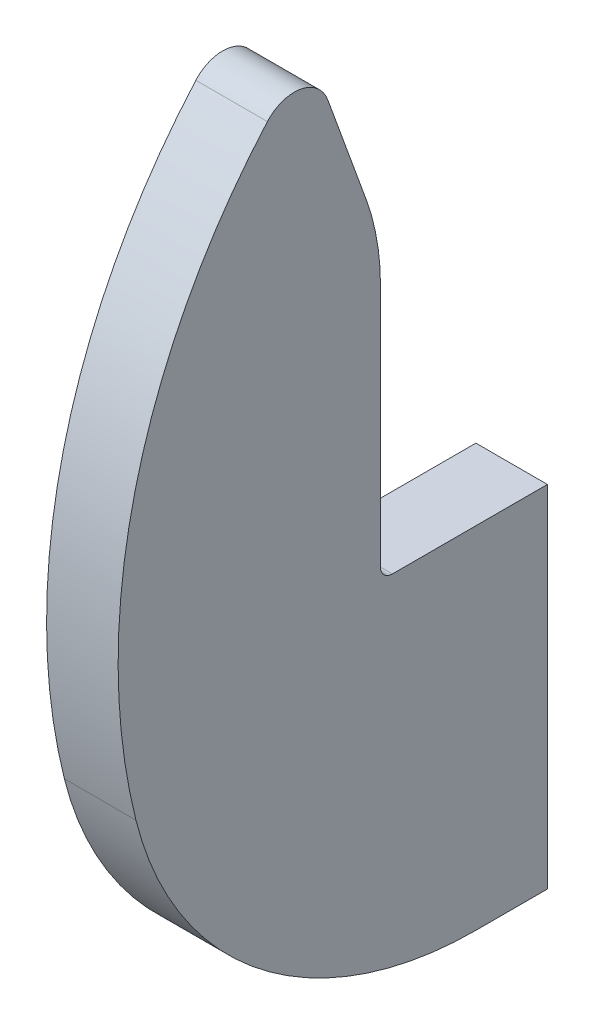
ISO-10303-21;
HEADER;
FILE_DESCRIPTION(('STEP AP214'),'2;1');
FILE_NAME('part.step','',(''),(''),'','','');
FILE_SCHEMA(('AUTOMOTIVE_DESIGN { 1 0 10303 214 1 1 1 1 }'));
ENDSEC;
DATA;
#1=APPLICATION_CONTEXT('core data for automotive mechanical design processes');
#2=APPLICATION_PROTOCOL_DEFINITION('international standard','automotive_design',2000,#1);
#3=PRODUCT_CONTEXT('',#1,'mechanical');
#4=PRODUCT('Part','Part','',(#3));
#5=PRODUCT_RELATED_PRODUCT_CATEGORY('part','',(#4));
#6=PRODUCT_DEFINITION_FORMATION('','',#4);
#7=PRODUCT_DEFINITION_CONTEXT('part definition',#1,'design');
#8=PRODUCT_DEFINITION('design','',#6,#7);
#9=PRODUCT_DEFINITION_SHAPE('','',#8);
#10=(LENGTH_UNIT() NAMED_UNIT(*) SI_UNIT(.MILLI.,.METRE.));
#11=(NAMED_UNIT(*) PLANE_ANGLE_UNIT() SI_UNIT($,.RADIAN.));
#12=(NAMED_UNIT(*) SI_UNIT($,.STERADIAN.) SOLID_ANGLE_UNIT());
#13=UNCERTAINTY_MEASURE_WITH_UNIT(LENGTH_MEASURE(1.E-05),#10,'distance_accuracy_value','');
#14=(GEOMETRIC_REPRESENTATION_CONTEXT(3) GLOBAL_UNCERTAINTY_ASSIGNED_CONTEXT((#13)) GLOBAL_UNIT_ASSIGNED_CONTEXT((#10,
#11,#12)) REPRESENTATION_CONTEXT('',''));
#15=CARTESIAN_POINT('',(0.,0.,0.));
#16=DIRECTION('',(0.,0.,1.));
#17=DIRECTION('',(1.,0.,0.));
#18=AXIS2_PLACEMENT_3D('',#15,#16,#17);
#19=CARTESIAN_POINT('',(298.,590.,586.887726592989));
#20=DIRECTION('',(0.,0.,-1.));
#21=DIRECTION('',(-1.,0.,0.));
#22=AXIS2_PLACEMENT_3D('',#19,#20,#21);
#23=PLANE('',#22);
#24=DIRECTION('',(0.,-1.,0.));
#25=VECTOR('',#24,1.);
#26=CARTESIAN_POINT('',(298.,590.,586.887726592989));
#27=LINE('',#26,#25);
#28=CARTESIAN_POINT('',(298.,611.473460385831,586.887726592989));
#29=VERTEX_POINT('',#28);
#30=CARTESIAN_POINT('',(298.,591.,586.887726592989));
#31=VERTEX_POINT('',#30);
#32=EDGE_CURVE('E118',#29,#31,#27,.T.);
#33=ORIENTED_EDGE('',*,*,#32,.T.);
#34=DIRECTION('',(-1.,0.,0.));
#35=VECTOR('',#34,1.);
#36=CARTESIAN_POINT('',(292.,591.,586.887726592989));
#37=LINE('',#36,#35);
#38=CARTESIAN_POINT('',(292.,591.,586.887726592989));
#39=VERTEX_POINT('',#38);
#40=EDGE_CURVE('E185',#31,#39,#37,.T.);
#41=ORIENTED_EDGE('',*,*,#40,.T.);
#42=DIRECTION('',(0.,-1.,0.));
#43=VECTOR('',#42,1.);
#44=CARTESIAN_POINT('',(292.,590.,586.887726592989));
#45=LINE('',#44,#43);
#46=CARTESIAN_POINT('',(292.,611.473460385831,586.887726592989));
#47=VERTEX_POINT('',#46);
#48=EDGE_CURVE('E145',#47,#39,#45,.T.);
#49=ORIENTED_EDGE('',*,*,#48,.F.);
#50=DIRECTION('',(-1.,0.,0.));
#51=VECTOR('',#50,1.);
#52=CARTESIAN_POINT('',(298.,611.473460385831,586.887726592989));
#53=LINE('',#52,#51);
#54=EDGE_CURVE('E171',#47,#29,#53,.F.);
#55=ORIENTED_EDGE('',*,*,#54,.T.);
#56=EDGE_LOOP('',(#33,#41,#49,#55));
#57=FACE_BOUND('',#56,.T.);
#58=ADVANCED_FACE('F36',(#57),#23,.T.);
#59=CARTESIAN_POINT('',(298.,615.,586.887726592989));
#60=DIRECTION('',(0.,0.34202014332568,-0.939692620785904));
#61=DIRECTION('',(0.,0.939692620785905,0.34202014332568));
#62=AXIS2_PLACEMENT_3D('',#59,#60,#61);
#63=PLANE('',#62);
#64=DIRECTION('',(0.,-0.939692620785904,-0.34202014332568));
#65=VECTOR('',#64,1.);
#66=CARTESIAN_POINT('',(292.,615.,586.887726592989));
#67=LINE('',#66,#65);
#68=CARTESIAN_POINT('',(292.,627.13122463831,591.303131266531));
#69=VERTEX_POINT('',#68);
#70=CARTESIAN_POINT('',(292.,618.313863252344,588.093874177271));
#71=VERTEX_POINT('',#70);
#72=EDGE_CURVE('E159',#69,#71,#67,.T.);
#73=ORIENTED_EDGE('',*,*,#72,.F.);
#74=DIRECTION('',(-1.,0.,0.));
#75=VECTOR('',#74,1.);
#76=CARTESIAN_POINT('',(298.,627.13122463831,591.303131266531));
#77=LINE('',#76,#75);
#78=CARTESIAN_POINT('',(298.,627.13122463831,591.303131266531));
#79=VERTEX_POINT('',#78);
#80=EDGE_CURVE('E181',#69,#79,#77,.F.);
#81=ORIENTED_EDGE('',*,*,#80,.T.);
#82=DIRECTION('',(0.,-0.939692620785904,-0.34202014332568));
#83=VECTOR('',#82,1.);
#84=CARTESIAN_POINT('',(298.,615.,586.887726592989));
#85=LINE('',#84,#83);
#86=CARTESIAN_POINT('',(298.,618.313863252344,588.093874177271));
#87=VERTEX_POINT('',#86);
#88=EDGE_CURVE('E126',#79,#87,#85,.T.);
#89=ORIENTED_EDGE('',*,*,#88,.T.);
#90=DIRECTION('',(-1.,0.,0.));
#91=VECTOR('',#90,1.);
#92=CARTESIAN_POINT('',(298.,618.313863252344,588.093874177271));
#93=LINE('',#92,#91);
#94=EDGE_CURVE('E163',#87,#71,#93,.T.);
#95=ORIENTED_EDGE('',*,*,#94,.T.);
#96=EDGE_LOOP('',(#73,#81,#89,#95));
#97=FACE_BOUND('',#96,.T.);
#98=ADVANCED_FACE('F203',(#97),#63,.T.);
#99=CARTESIAN_POINT('',(298.,595.,558.887726592989));
#100=DIRECTION('',(-1.,0.,0.));
#101=DIRECTION('',(0.,0.,1.));
#102=AXIS2_PLACEMENT_3D('',#99,#100,#101);
#103=CYLINDRICAL_SURFACE('',#102,50.);
#104=CARTESIAN_POINT('',(298.,595.,558.887726592989));
#105=DIRECTION('',(-1.,0.,0.));
#106=DIRECTION('',(0.,0.,1.));
#107=AXIS2_PLACEMENT_3D('',#104,#105,#106);
#108=CIRCLE('',#107,50.);
#109=CARTESIAN_POINT('',(298.,582.873218748183,607.394851600256));
#110=VERTEX_POINT('',#109);
#111=CARTESIAN_POINT('',(298.,628.090600221631,596.371218652457));
#112=VERTEX_POINT('',#111);
#113=EDGE_CURVE('E141',#110,#112,#108,.T.);
#114=ORIENTED_EDGE('',*,*,#113,.T.);
#115=DIRECTION('',(-1.,0.,0.));
#116=VECTOR('',#115,1.);
#117=CARTESIAN_POINT('',(298.,628.090600221631,596.371218652457));
#118=LINE('',#117,#116);
#119=CARTESIAN_POINT('',(292.,628.090600221631,596.371218652457));
#120=VERTEX_POINT('',#119);
#121=EDGE_CURVE('E176',#112,#120,#118,.T.);
#122=ORIENTED_EDGE('',*,*,#121,.T.);
#123=CARTESIAN_POINT('',(292.,595.,558.887726592989));
#124=DIRECTION('',(-1.,0.,0.));
#125=DIRECTION('',(0.,0.,1.));
#126=AXIS2_PLACEMENT_3D('',#123,#124,#125);
#127=CIRCLE('',#126,50.);
#128=CARTESIAN_POINT('',(292.,582.873218748183,607.394851600256));
#129=VERTEX_POINT('',#128);
#130=EDGE_CURVE('E156',#129,#120,#127,.T.);
#131=ORIENTED_EDGE('',*,*,#130,.F.);
#132=DIRECTION('',(-1.,0.,0.));
#133=VECTOR('',#132,1.);
#134=CARTESIAN_POINT('',(298.,582.873218748183,607.394851600256));
#135=LINE('',#134,#133);
#136=EDGE_CURVE('E161',#110,#129,#135,.T.);
#137=ORIENTED_EDGE('',*,*,#136,.F.);
#138=EDGE_LOOP('',(#114,#122,#131,#137));
#139=FACE_BOUND('',#138,.T.);
#140=ADVANCED_FACE('F217',(#139),#103,.T.);
#141=CARTESIAN_POINT('',(298.,590.,578.88772659299));
#142=DIRECTION('',(-1.,0.,0.));
#143=DIRECTION('',(0.,0.,1.));
#144=AXIS2_PLACEMENT_3D('',#141,#142,#143);
#145=CYLINDRICAL_SURFACE('',#144,29.3844718719115);
#146=CARTESIAN_POINT('',(292.,590.,578.88772659299));
#147=DIRECTION('',(-1.,0.,0.));
#148=DIRECTION('',(0.,0.,1.));
#149=AXIS2_PLACEMENT_3D('',#146,#147,#148);
#150=CIRCLE('',#149,29.3844718719115);
#151=CARTESIAN_POINT('',(292.,560.615528128088,578.88772659299));
#152=VERTEX_POINT('',#151);
#153=EDGE_CURVE('E153',#152,#129,#150,.T.);
#154=ORIENTED_EDGE('',*,*,#153,.F.);
#155=DIRECTION('',(-1.,0.,0.));
#156=VECTOR('',#155,1.);
#157=CARTESIAN_POINT('',(298.,560.615528128088,578.88772659299));
#158=LINE('',#157,#156);
#159=CARTESIAN_POINT('',(298.,560.615528128088,578.88772659299));
#160=VERTEX_POINT('',#159);
#161=EDGE_CURVE('E164',#160,#152,#158,.T.);
#162=ORIENTED_EDGE('',*,*,#161,.F.);
#163=CARTESIAN_POINT('',(298.,590.,578.88772659299));
#164=DIRECTION('',(-1.,0.,0.));
#165=DIRECTION('',(0.,0.,1.));
#166=AXIS2_PLACEMENT_3D('',#163,#164,#165);
#167=CIRCLE('',#166,29.3844718719115);
#168=EDGE_CURVE('E135',#160,#110,#167,.T.);
#169=ORIENTED_EDGE('',*,*,#168,.T.);
#170=ORIENTED_EDGE('',*,*,#136,.T.);
#171=EDGE_LOOP('',(#154,#162,#169,#170));
#172=FACE_BOUND('',#171,.T.);
#173=ADVANCED_FACE('F234',(#172),#145,.T.);
#174=CARTESIAN_POINT('',(298.,560.615528128088,578.88772659299));
#175=DIRECTION('',(0.,-1.,0.));
#176=DIRECTION('',(0.,0.,-1.));
#177=AXIS2_PLACEMENT_3D('',#174,#175,#176);
#178=PLANE('',#177);
#179=DIRECTION('',(0.,0.,1.));
#180=VECTOR('',#179,1.);
#181=CARTESIAN_POINT('',(292.,560.615528128088,578.88772659299));
#182=LINE('',#181,#180);
#183=CARTESIAN_POINT('',(292.,560.615528128088,572.88772659299));
#184=VERTEX_POINT('',#183);
#185=EDGE_CURVE('E150',#184,#152,#182,.T.);
#186=ORIENTED_EDGE('',*,*,#185,.F.);
#187=DIRECTION('',(-1.,0.,0.));
#188=VECTOR('',#187,1.);
#189=CARTESIAN_POINT('',(298.,560.615528128088,572.88772659299));
#190=LINE('',#189,#188);
#191=CARTESIAN_POINT('',(298.,560.615528128088,572.88772659299));
#192=VERTEX_POINT('',#191);
#193=EDGE_CURVE('E125',#192,#184,#190,.T.);
#194=ORIENTED_EDGE('',*,*,#193,.F.);
#195=DIRECTION('',(0.,0.,1.));
#196=VECTOR('',#195,1.);
#197=CARTESIAN_POINT('',(298.,560.615528128088,578.88772659299));
#198=LINE('',#197,#196);
#199=EDGE_CURVE('E133',#192,#160,#198,.T.);
#200=ORIENTED_EDGE('',*,*,#199,.T.);
#201=ORIENTED_EDGE('',*,*,#161,.T.);
#202=EDGE_LOOP('',(#186,#194,#200,#201));
#203=FACE_BOUND('',#202,.T.);
#204=ADVANCED_FACE('F238',(#203),#178,.T.);
#205=CARTESIAN_POINT('',(298.,560.615528128088,572.88772659299));
#206=DIRECTION('',(0.,0.,-1.));
#207=DIRECTION('',(-1.,0.,0.));
#208=AXIS2_PLACEMENT_3D('',#205,#206,#207);
#209=PLANE('',#208);
#210=DIRECTION('',(0.,-1.,0.));
#211=VECTOR('',#210,1.);
#212=CARTESIAN_POINT('',(292.,560.615528128088,572.88772659299));
#213=LINE('',#212,#211);
#214=CARTESIAN_POINT('',(292.,590.,572.88772659299));
#215=VERTEX_POINT('',#214);
#216=EDGE_CURVE('E124',#215,#184,#213,.T.);
#217=ORIENTED_EDGE('',*,*,#216,.F.);
#218=DIRECTION('',(-1.,0.,0.));
#219=VECTOR('',#218,1.);
#220=CARTESIAN_POINT('',(298.,590.,572.88772659299));
#221=LINE('',#220,#219);
#222=CARTESIAN_POINT('',(298.,590.,572.88772659299));
#223=VERTEX_POINT('',#222);
#224=EDGE_CURVE('E112',#223,#215,#221,.T.);
#225=ORIENTED_EDGE('',*,*,#224,.F.);
#226=DIRECTION('',(0.,-1.,0.));
#227=VECTOR('',#226,1.);
#228=CARTESIAN_POINT('',(298.,560.615528128088,572.88772659299));
#229=LINE('',#228,#227);
#230=EDGE_CURVE('E117',#223,#192,#229,.T.);
#231=ORIENTED_EDGE('',*,*,#230,.T.);
#232=ORIENTED_EDGE('',*,*,#193,.T.);
#233=EDGE_LOOP('',(#217,#225,#231,#232));
#234=FACE_BOUND('',#233,.T.);
#235=ADVANCED_FACE('F122',(#234),#209,.T.);
#236=CARTESIAN_POINT('',(298.,590.,572.88772659299));
#237=DIRECTION('',(0.,1.,0.));
#238=DIRECTION('',(0.,0.,1.));
#239=AXIS2_PLACEMENT_3D('',#236,#237,#238);
#240=PLANE('',#239);
#241=DIRECTION('',(0.,0.,-1.));
#242=VECTOR('',#241,1.);
#243=CARTESIAN_POINT('',(292.,590.,572.88772659299));
#244=LINE('',#243,#242);
#245=CARTESIAN_POINT('',(292.,590.,585.887726592989));
#246=VERTEX_POINT('',#245);
#247=EDGE_CURVE('E147',#246,#215,#244,.T.);
#248=ORIENTED_EDGE('',*,*,#247,.F.);
#249=DIRECTION('',(-1.,0.,0.));
#250=VECTOR('',#249,1.);
#251=CARTESIAN_POINT('',(298.,590.,585.887726592989));
#252=LINE('',#251,#250);
#253=CARTESIAN_POINT('',(298.,590.,585.887726592989));
#254=VERTEX_POINT('',#253);
#255=EDGE_CURVE('E51',#246,#254,#252,.F.);
#256=ORIENTED_EDGE('',*,*,#255,.T.);
#257=DIRECTION('',(0.,0.,-1.));
#258=VECTOR('',#257,1.);
#259=CARTESIAN_POINT('',(298.,590.,586.887726592989));
#260=LINE('',#259,#258);
#261=EDGE_CURVE('E109',#254,#223,#260,.T.);
#262=ORIENTED_EDGE('',*,*,#261,.T.);
#263=ORIENTED_EDGE('',*,*,#224,.T.);
#264=EDGE_LOOP('',(#248,#256,#262,#263));
#265=FACE_BOUND('',#264,.T.);
#266=ADVANCED_FACE('F111',(#265),#240,.T.);
#267=CARTESIAN_POINT('',(298.,595.,558.887726592989));
#268=DIRECTION('',(-1.,0.,0.));
#269=DIRECTION('',(0.,0.,1.));
#270=AXIS2_PLACEMENT_3D('',#267,#268,#269);
#271=PLANE('',#270);
#272=ORIENTED_EDGE('',*,*,#88,.F.);
#273=CARTESIAN_POINT('',(298.,626.105164208333,594.122209128889));
#274=DIRECTION('',(-1.,0.,0.));
#275=DIRECTION('',(0.,0.,1.));
#276=AXIS2_PLACEMENT_3D('',#273,#274,#275);
#277=CIRCLE('',#276,3.);
#278=EDGE_CURVE('E183',#79,#112,#277,.F.);
#279=ORIENTED_EDGE('',*,*,#278,.T.);
#280=ORIENTED_EDGE('',*,*,#113,.F.);
#281=ORIENTED_EDGE('',*,*,#168,.F.);
#282=ORIENTED_EDGE('',*,*,#199,.F.);
#283=ORIENTED_EDGE('',*,*,#230,.F.);
#284=ORIENTED_EDGE('',*,*,#261,.F.);
#285=CARTESIAN_POINT('',(298.,591.,585.887726592989));
#286=DIRECTION('',(-1.,0.,0.));
#287=DIRECTION('',(0.,0.,1.));
#288=AXIS2_PLACEMENT_3D('',#285,#286,#287);
#289=CIRCLE('',#288,1.);
#290=EDGE_CURVE('E11',#254,#31,#289,.T.);
#291=ORIENTED_EDGE('',*,*,#290,.T.);
#292=ORIENTED_EDGE('',*,*,#32,.F.);
#293=CARTESIAN_POINT('',(298.,611.473460385831,606.887726592989));
#294=DIRECTION('',(-1.,0.,0.));
#295=DIRECTION('',(0.,0.,1.));
#296=AXIS2_PLACEMENT_3D('',#293,#294,#295);
#297=CIRCLE('',#296,20.);
#298=EDGE_CURVE('E173',#29,#87,#297,.F.);
#299=ORIENTED_EDGE('',*,*,#298,.T.);
#300=EDGE_LOOP('',(#272,#279,#280,#281,#282,#283,#284,#291,#292,#299));
#301=FACE_BOUND('',#300,.T.);
#302=ADVANCED_FACE('F130',(#301),#271,.F.);
#303=CARTESIAN_POINT('',(292.,595.,558.887726592989));
#304=DIRECTION('',(-1.,0.,0.));
#305=DIRECTION('',(0.,0.,1.));
#306=AXIS2_PLACEMENT_3D('',#303,#304,#305);
#307=PLANE('',#306);
#308=ORIENTED_EDGE('',*,*,#130,.T.);
#309=CARTESIAN_POINT('',(292.,626.105164208333,594.122209128889));
#310=DIRECTION('',(-1.,0.,0.));
#311=DIRECTION('',(0.,0.,1.));
#312=AXIS2_PLACEMENT_3D('',#309,#310,#311);
#313=CIRCLE('',#312,3.);
#314=EDGE_CURVE('E179',#120,#69,#313,.T.);
#315=ORIENTED_EDGE('',*,*,#314,.T.);
#316=ORIENTED_EDGE('',*,*,#72,.T.);
#317=CARTESIAN_POINT('',(292.,611.473460385831,606.887726592989));
#318=DIRECTION('',(-1.,0.,0.));
#319=DIRECTION('',(0.,0.,1.));
#320=AXIS2_PLACEMENT_3D('',#317,#318,#319);
#321=CIRCLE('',#320,20.);
#322=EDGE_CURVE('E169',#71,#47,#321,.T.);
#323=ORIENTED_EDGE('',*,*,#322,.T.);
#324=ORIENTED_EDGE('',*,*,#48,.T.);
#325=CARTESIAN_POINT('',(292.,591.,585.887726592989));
#326=DIRECTION('',(-1.,0.,0.));
#327=DIRECTION('',(0.,0.,1.));
#328=AXIS2_PLACEMENT_3D('',#325,#326,#327);
#329=CIRCLE('',#328,1.);
#330=EDGE_CURVE('E44',#39,#246,#329,.F.);
#331=ORIENTED_EDGE('',*,*,#330,.T.);
#332=ORIENTED_EDGE('',*,*,#247,.T.);
#333=ORIENTED_EDGE('',*,*,#216,.T.);
#334=ORIENTED_EDGE('',*,*,#185,.T.);
#335=ORIENTED_EDGE('',*,*,#153,.T.);
#336=EDGE_LOOP('',(#308,#315,#316,#323,#324,#331,#332,#333,#334,#335));
#337=FACE_BOUND('',#336,.T.);
#338=ADVANCED_FACE('F195',(#337),#307,.T.);
#339=CARTESIAN_POINT('',(298.,611.473460385831,606.887726592989));
#340=DIRECTION('',(-1.,0.,0.));
#341=DIRECTION('',(0.,0.,1.));
#342=AXIS2_PLACEMENT_3D('',#339,#340,#341);
#343=CYLINDRICAL_SURFACE('',#342,20.);
#344=ORIENTED_EDGE('',*,*,#298,.F.);
#345=ORIENTED_EDGE('',*,*,#54,.F.);
#346=ORIENTED_EDGE('',*,*,#322,.F.);
#347=ORIENTED_EDGE('',*,*,#94,.F.);
#348=EDGE_LOOP('',(#344,#345,#346,#347));
#349=FACE_BOUND('',#348,.T.);
#350=ADVANCED_FACE('F201',(#349),#343,.T.);
#351=CARTESIAN_POINT('',(298.,626.105164208333,594.122209128889));
#352=DIRECTION('',(-1.,0.,0.));
#353=DIRECTION('',(0.,0.,1.));
#354=AXIS2_PLACEMENT_3D('',#351,#352,#353);
#355=CYLINDRICAL_SURFACE('',#354,3.);
#356=ORIENTED_EDGE('',*,*,#278,.F.);
#357=ORIENTED_EDGE('',*,*,#80,.F.);
#358=ORIENTED_EDGE('',*,*,#314,.F.);
#359=ORIENTED_EDGE('',*,*,#121,.F.);
#360=EDGE_LOOP('',(#356,#357,#358,#359));
#361=FACE_BOUND('',#360,.T.);
#362=ADVANCED_FACE('F207',(#361),#355,.T.);
#363=CARTESIAN_POINT('',(298.,591.,585.887726592989));
#364=DIRECTION('',(1.,0.,0.));
#365=DIRECTION('',(0.,0.,-1.));
#366=AXIS2_PLACEMENT_3D('',#363,#364,#365);
#367=CYLINDRICAL_SURFACE('',#366,1.);
#368=ORIENTED_EDGE('',*,*,#290,.F.);
#369=ORIENTED_EDGE('',*,*,#255,.F.);
#370=ORIENTED_EDGE('',*,*,#330,.F.);
#371=ORIENTED_EDGE('',*,*,#40,.F.);
#372=EDGE_LOOP('',(#368,#369,#370,#371));
#373=FACE_BOUND('',#372,.T.);
#374=ADVANCED_FACE('F38',(#373),#367,.F.);
#375=CLOSED_SHELL('',(#58,#98,#140,#173,#204,#235,#266,#302,#338,#350,#362,#374));
#376=MANIFOLD_SOLID_BREP('B2',#375);
#377=ADVANCED_BREP_SHAPE_REPRESENTATION('',(#18,#376),#14);
#378=SHAPE_DEFINITION_REPRESENTATION(#9,#377);
ENDSEC;
END-ISO-10303-21;
